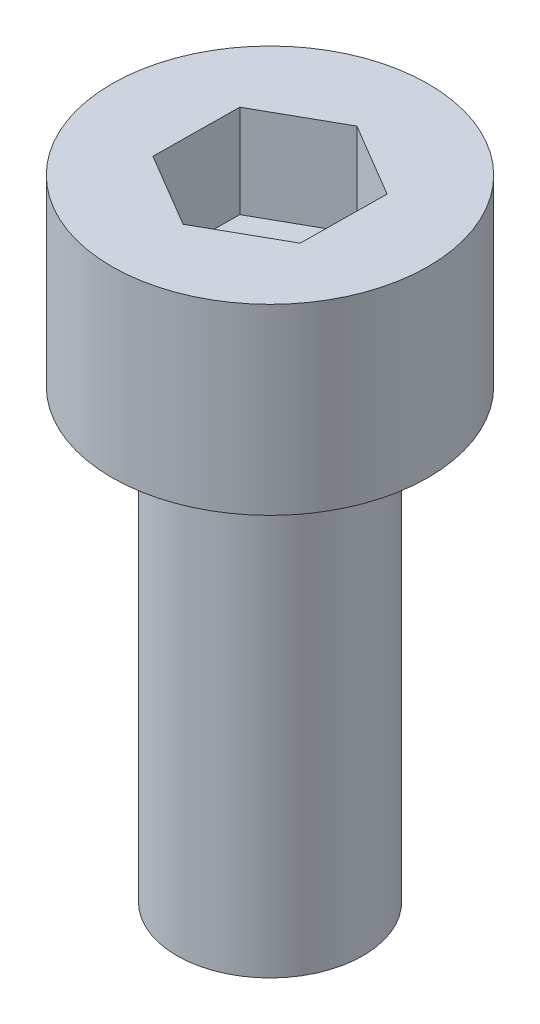
ISO-10303-21;
HEADER;
FILE_DESCRIPTION(('STEP AP214'),'2;1');
FILE_NAME('part.step','',(''),(''),'','','');
FILE_SCHEMA(('AUTOMOTIVE_DESIGN { 1 0 10303 214 1 1 1 1 }'));
ENDSEC;
DATA;
#1=APPLICATION_CONTEXT('core data for automotive mechanical design processes');
#2=APPLICATION_PROTOCOL_DEFINITION('international standard','automotive_design',2000,#1);
#3=PRODUCT_CONTEXT('',#1,'mechanical');
#4=PRODUCT('Part','Part','',(#3));
#5=PRODUCT_RELATED_PRODUCT_CATEGORY('part','',(#4));
#6=PRODUCT_DEFINITION_FORMATION('','',#4);
#7=PRODUCT_DEFINITION_CONTEXT('part definition',#1,'design');
#8=PRODUCT_DEFINITION('design','',#6,#7);
#9=PRODUCT_DEFINITION_SHAPE('','',#8);
#10=(LENGTH_UNIT() NAMED_UNIT(*) SI_UNIT(.MILLI.,.METRE.));
#11=(NAMED_UNIT(*) PLANE_ANGLE_UNIT() SI_UNIT($,.RADIAN.));
#12=(NAMED_UNIT(*) SI_UNIT($,.STERADIAN.) SOLID_ANGLE_UNIT());
#13=UNCERTAINTY_MEASURE_WITH_UNIT(LENGTH_MEASURE(1.E-05),#10,'distance_accuracy_value','');
#14=(GEOMETRIC_REPRESENTATION_CONTEXT(3) GLOBAL_UNCERTAINTY_ASSIGNED_CONTEXT((#13)) GLOBAL_UNIT_ASSIGNED_CONTEXT((#10,
#11,#12)) REPRESENTATION_CONTEXT('',''));
#15=CARTESIAN_POINT('',(0.,0.,0.));
#16=DIRECTION('',(0.,0.,1.));
#17=DIRECTION('',(1.,0.,0.));
#18=AXIS2_PLACEMENT_3D('',#15,#16,#17);
#19=CARTESIAN_POINT('',(0.,12.,0.));
#20=DIRECTION('',(0.,-1.,0.));
#21=DIRECTION('',(0.,0.,-1.));
#22=AXIS2_PLACEMENT_3D('',#19,#20,#21);
#23=CYLINDRICAL_SURFACE('',#22,2.5);
#24=CARTESIAN_POINT('',(0.,12.,0.));
#25=DIRECTION('',(0.,1.,0.));
#26=DIRECTION('',(0.,0.,1.));
#27=AXIS2_PLACEMENT_3D('',#24,#25,#26);
#28=CIRCLE('',#27,2.5);
#29=CARTESIAN_POINT('',(0.,12.,2.5));
#30=VERTEX_POINT('',#29);
#31=EDGE_CURVE('E11',#30,#30,#28,.T.);
#32=ORIENTED_EDGE('',*,*,#31,.F.);
#33=EDGE_LOOP('',(#32));
#34=FACE_BOUND('',#33,.T.);
#35=CARTESIAN_POINT('',(0.,0.,0.));
#36=DIRECTION('',(0.,1.,0.));
#37=DIRECTION('',(0.,0.,1.));
#38=AXIS2_PLACEMENT_3D('',#35,#36,#37);
#39=CIRCLE('',#38,2.5);
#40=CARTESIAN_POINT('',(0.,0.,2.5));
#41=VERTEX_POINT('',#40);
#42=EDGE_CURVE('E42',#41,#41,#39,.T.);
#43=ORIENTED_EDGE('',*,*,#42,.T.);
#44=EDGE_LOOP('',(#43));
#45=FACE_BOUND('',#44,.T.);
#46=ADVANCED_FACE('F39',(#34,#45),#23,.T.);
#47=CARTESIAN_POINT('',(0.,0.,0.));
#48=DIRECTION('',(0.,1.,0.));
#49=DIRECTION('',(0.,0.,1.));
#50=AXIS2_PLACEMENT_3D('',#47,#48,#49);
#51=PLANE('',#50);
#52=ORIENTED_EDGE('',*,*,#42,.F.);
#53=EDGE_LOOP('',(#52));
#54=FACE_BOUND('',#53,.T.);
#55=ADVANCED_FACE('F189',(#54),#51,.F.);
#56=CARTESIAN_POINT('',(0.,16.91,0.));
#57=DIRECTION('',(0.,-1.,0.));
#58=DIRECTION('',(0.,0.,-1.));
#59=AXIS2_PLACEMENT_3D('',#56,#57,#58);
#60=CYLINDRICAL_SURFACE('',#59,4.25);
#61=CARTESIAN_POINT('',(0.,16.91,0.));
#62=DIRECTION('',(0.,1.,0.));
#63=DIRECTION('',(0.,0.,1.));
#64=AXIS2_PLACEMENT_3D('',#61,#62,#63);
#65=CIRCLE('',#64,4.25);
#66=CARTESIAN_POINT('',(0.,16.91,4.25));
#67=VERTEX_POINT('',#66);
#68=EDGE_CURVE('E163',#67,#67,#65,.T.);
#69=ORIENTED_EDGE('',*,*,#68,.F.);
#70=EDGE_LOOP('',(#69));
#71=FACE_BOUND('',#70,.T.);
#72=CARTESIAN_POINT('',(0.,12.,0.));
#73=DIRECTION('',(0.,1.,0.));
#74=DIRECTION('',(0.,0.,1.));
#75=AXIS2_PLACEMENT_3D('',#72,#73,#74);
#76=CIRCLE('',#75,4.25);
#77=CARTESIAN_POINT('',(0.,12.,4.25));
#78=VERTEX_POINT('',#77);
#79=EDGE_CURVE('E153',#78,#78,#76,.T.);
#80=ORIENTED_EDGE('',*,*,#79,.T.);
#81=EDGE_LOOP('',(#80));
#82=FACE_BOUND('',#81,.T.);
#83=ADVANCED_FACE('F171',(#71,#82),#60,.T.);
#84=CARTESIAN_POINT('',(0.,16.91,0.));
#85=DIRECTION('',(0.,1.,0.));
#86=DIRECTION('',(0.,0.,1.));
#87=AXIS2_PLACEMENT_3D('',#84,#85,#86);
#88=PLANE('',#87);
#89=DIRECTION('',(0.871446941935933,0.,-0.490489783166286));
#90=VECTOR('',#89,1.);
#91=CARTESIAN_POINT('',(-0.0252806866898007,16.91,2.3092627005635));
#92=LINE('',#91,#90);
#93=CARTESIAN_POINT('',(-0.0252806866898007,16.91,2.3092627005635));
#94=VERTEX_POINT('',#93);
#95=CARTESIAN_POINT('',(1.98723981935495,16.91,1.17652506718023));
#96=VERTEX_POINT('',#95);
#97=EDGE_CURVE('E54',#94,#96,#92,.T.);
#98=ORIENTED_EDGE('',*,*,#97,.F.);
#99=DIRECTION('',(0.860500083486691,0.,0.509450298183638));
#100=VECTOR('',#99,1.);
#101=CARTESIAN_POINT('',(-2.01252050604475,16.91,1.13273763338327));
#102=LINE('',#101,#100);
#103=CARTESIAN_POINT('',(-2.01252050604475,16.91,1.13273763338327));
#104=VERTEX_POINT('',#103);
#105=EDGE_CURVE('E147',#104,#94,#102,.T.);
#106=ORIENTED_EDGE('',*,*,#105,.F.);
#107=DIRECTION('',(-0.0109468584492415,0.,0.999940081349924));
#108=VECTOR('',#107,1.);
#109=CARTESIAN_POINT('',(-1.98723981935495,16.91,-1.17652506718023));
#110=LINE('',#109,#108);
#111=CARTESIAN_POINT('',(-1.98723981935495,16.91,-1.17652506718023));
#112=VERTEX_POINT('',#111);
#113=EDGE_CURVE('E144',#112,#104,#110,.T.);
#114=ORIENTED_EDGE('',*,*,#113,.F.);
#115=DIRECTION('',(-0.871446941935933,0.,0.490489783166286));
#116=VECTOR('',#115,1.);
#117=CARTESIAN_POINT('',(0.0252806866898017,16.91,-2.3092627005635));
#118=LINE('',#117,#116);
#119=CARTESIAN_POINT('',(0.0252806866898017,16.91,-2.3092627005635));
#120=VERTEX_POINT('',#119);
#121=EDGE_CURVE('E102',#120,#112,#118,.T.);
#122=ORIENTED_EDGE('',*,*,#121,.F.);
#123=DIRECTION('',(-0.860500083486691,0.,-0.509450298183638));
#124=VECTOR('',#123,1.);
#125=CARTESIAN_POINT('',(2.01252050604475,16.91,-1.13273763338327));
#126=LINE('',#125,#124);
#127=CARTESIAN_POINT('',(2.01252050604475,16.91,-1.13273763338327));
#128=VERTEX_POINT('',#127);
#129=EDGE_CURVE('E138',#128,#120,#126,.T.);
#130=ORIENTED_EDGE('',*,*,#129,.F.);
#131=DIRECTION('',(0.0109468584492411,0.,-0.999940081349924));
#132=VECTOR('',#131,1.);
#133=CARTESIAN_POINT('',(1.98723981935495,16.91,1.17652506718023));
#134=LINE('',#133,#132);
#135=EDGE_CURVE('E134',#96,#128,#134,.T.);
#136=ORIENTED_EDGE('',*,*,#135,.F.);
#137=EDGE_LOOP('',(#98,#106,#114,#122,#130,#136));
#138=FACE_BOUND('',#137,.T.);
#139=ORIENTED_EDGE('',*,*,#68,.T.);
#140=EDGE_LOOP('',(#139));
#141=FACE_BOUND('',#140,.T.);
#142=ADVANCED_FACE('F176',(#138,#141),#88,.T.);
#143=CARTESIAN_POINT('',(0.,12.,0.));
#144=DIRECTION('',(0.,1.,0.));
#145=DIRECTION('',(0.,0.,1.));
#146=AXIS2_PLACEMENT_3D('',#143,#144,#145);
#147=PLANE('',#146);
#148=ORIENTED_EDGE('',*,*,#31,.T.);
#149=EDGE_LOOP('',(#148));
#150=FACE_BOUND('',#149,.T.);
#151=ORIENTED_EDGE('',*,*,#79,.F.);
#152=EDGE_LOOP('',(#151));
#153=FACE_BOUND('',#152,.T.);
#154=ADVANCED_FACE('F173',(#150,#153),#147,.F.);
#155=CARTESIAN_POINT('',(-0.0252806866898007,14.41,2.3092627005635));
#156=DIRECTION('',(0.490489783166286,0.,0.871446941935933));
#157=DIRECTION('',(0.871446941935933,0.,-0.490489783166286));
#158=AXIS2_PLACEMENT_3D('',#155,#156,#157);
#159=PLANE('',#158);
#160=ORIENTED_EDGE('',*,*,#97,.T.);
#161=DIRECTION('',(0.,1.,0.));
#162=VECTOR('',#161,1.);
#163=CARTESIAN_POINT('',(1.98723981935495,14.41,1.17652506718023));
#164=LINE('',#163,#162);
#165=CARTESIAN_POINT('',(1.98723981935495,14.41,1.17652506718023));
#166=VERTEX_POINT('',#165);
#167=EDGE_CURVE('E84',#166,#96,#164,.T.);
#168=ORIENTED_EDGE('',*,*,#167,.F.);
#169=DIRECTION('',(0.871446941935933,0.,-0.490489783166286));
#170=VECTOR('',#169,1.);
#171=CARTESIAN_POINT('',(-0.0252806866898007,14.41,2.3092627005635));
#172=LINE('',#171,#170);
#173=CARTESIAN_POINT('',(-0.0252806866898007,14.41,2.3092627005635));
#174=VERTEX_POINT('',#173);
#175=EDGE_CURVE('E150',#174,#166,#172,.T.);
#176=ORIENTED_EDGE('',*,*,#175,.F.);
#177=DIRECTION('',(0.,1.,0.));
#178=VECTOR('',#177,1.);
#179=CARTESIAN_POINT('',(-0.0252806866898007,14.41,2.3092627005635));
#180=LINE('',#179,#178);
#181=EDGE_CURVE('E62',#174,#94,#180,.T.);
#182=ORIENTED_EDGE('',*,*,#181,.T.);
#183=EDGE_LOOP('',(#160,#168,#176,#182));
#184=FACE_BOUND('',#183,.T.);
#185=ADVANCED_FACE('F175',(#184),#159,.F.);
#186=CARTESIAN_POINT('',(-2.01252050604475,14.41,1.13273763338327));
#187=DIRECTION('',(-0.509450298183638,0.,0.860500083486691));
#188=DIRECTION('',(0.860500083486691,0.,0.509450298183638));
#189=AXIS2_PLACEMENT_3D('',#186,#187,#188);
#190=PLANE('',#189);
#191=ORIENTED_EDGE('',*,*,#105,.T.);
#192=ORIENTED_EDGE('',*,*,#181,.F.);
#193=DIRECTION('',(0.860500083486691,0.,0.509450298183638));
#194=VECTOR('',#193,1.);
#195=CARTESIAN_POINT('',(-2.01252050604475,14.41,1.13273763338327));
#196=LINE('',#195,#194);
#197=CARTESIAN_POINT('',(-2.01252050604475,14.41,1.13273763338327));
#198=VERTEX_POINT('',#197);
#199=EDGE_CURVE('E116',#198,#174,#196,.T.);
#200=ORIENTED_EDGE('',*,*,#199,.F.);
#201=DIRECTION('',(0.,1.,0.));
#202=VECTOR('',#201,1.);
#203=CARTESIAN_POINT('',(-2.01252050604475,14.41,1.13273763338327));
#204=LINE('',#203,#202);
#205=EDGE_CURVE('E107',#198,#104,#204,.T.);
#206=ORIENTED_EDGE('',*,*,#205,.T.);
#207=EDGE_LOOP('',(#191,#192,#200,#206));
#208=FACE_BOUND('',#207,.T.);
#209=ADVANCED_FACE('F183',(#208),#190,.F.);
#210=CARTESIAN_POINT('',(-1.98723981935495,14.41,-1.17652506718023));
#211=DIRECTION('',(-0.999940081349924,0.,-0.0109468584492415));
#212=DIRECTION('',(-0.0109468584492415,0.,0.999940081349924));
#213=AXIS2_PLACEMENT_3D('',#210,#211,#212);
#214=PLANE('',#213);
#215=ORIENTED_EDGE('',*,*,#113,.T.);
#216=ORIENTED_EDGE('',*,*,#205,.F.);
#217=DIRECTION('',(-0.0109468584492415,0.,0.999940081349924));
#218=VECTOR('',#217,1.);
#219=CARTESIAN_POINT('',(-1.98723981935495,14.41,-1.17652506718023));
#220=LINE('',#219,#218);
#221=CARTESIAN_POINT('',(-1.98723981935495,14.41,-1.17652506718023));
#222=VERTEX_POINT('',#221);
#223=EDGE_CURVE('E111',#222,#198,#220,.T.);
#224=ORIENTED_EDGE('',*,*,#223,.F.);
#225=DIRECTION('',(0.,1.,0.));
#226=VECTOR('',#225,1.);
#227=CARTESIAN_POINT('',(-1.98723981935495,14.41,-1.17652506718023));
#228=LINE('',#227,#226);
#229=EDGE_CURVE('E95',#222,#112,#228,.T.);
#230=ORIENTED_EDGE('',*,*,#229,.T.);
#231=EDGE_LOOP('',(#215,#216,#224,#230));
#232=FACE_BOUND('',#231,.T.);
#233=ADVANCED_FACE('F112',(#232),#214,.F.);
#234=CARTESIAN_POINT('',(0.0252806866898017,14.41,-2.3092627005635));
#235=DIRECTION('',(-0.490489783166286,0.,-0.871446941935933));
#236=DIRECTION('',(-0.871446941935933,0.,0.490489783166286));
#237=AXIS2_PLACEMENT_3D('',#234,#235,#236);
#238=PLANE('',#237);
#239=ORIENTED_EDGE('',*,*,#121,.T.);
#240=ORIENTED_EDGE('',*,*,#229,.F.);
#241=DIRECTION('',(-0.871446941935933,0.,0.490489783166286));
#242=VECTOR('',#241,1.);
#243=CARTESIAN_POINT('',(0.0252806866898017,14.41,-2.3092627005635));
#244=LINE('',#243,#242);
#245=CARTESIAN_POINT('',(0.0252806866898017,14.41,-2.3092627005635));
#246=VERTEX_POINT('',#245);
#247=EDGE_CURVE('E99',#246,#222,#244,.T.);
#248=ORIENTED_EDGE('',*,*,#247,.F.);
#249=DIRECTION('',(0.,1.,0.));
#250=VECTOR('',#249,1.);
#251=CARTESIAN_POINT('',(0.0252806866898017,14.41,-2.3092627005635));
#252=LINE('',#251,#250);
#253=EDGE_CURVE('E108',#246,#120,#252,.T.);
#254=ORIENTED_EDGE('',*,*,#253,.T.);
#255=EDGE_LOOP('',(#239,#240,#248,#254));
#256=FACE_BOUND('',#255,.T.);
#257=ADVANCED_FACE('F97',(#256),#238,.F.);
#258=CARTESIAN_POINT('',(2.01252050604475,14.41,-1.13273763338327));
#259=DIRECTION('',(0.509450298183638,0.,-0.860500083486691));
#260=DIRECTION('',(-0.860500083486691,0.,-0.509450298183638));
#261=AXIS2_PLACEMENT_3D('',#258,#259,#260);
#262=PLANE('',#261);
#263=ORIENTED_EDGE('',*,*,#129,.T.);
#264=ORIENTED_EDGE('',*,*,#253,.F.);
#265=DIRECTION('',(-0.860500083486691,0.,-0.509450298183638));
#266=VECTOR('',#265,1.);
#267=CARTESIAN_POINT('',(2.01252050604475,14.41,-1.13273763338327));
#268=LINE('',#267,#266);
#269=CARTESIAN_POINT('',(2.01252050604475,14.41,-1.13273763338327));
#270=VERTEX_POINT('',#269);
#271=EDGE_CURVE('E122',#270,#246,#268,.T.);
#272=ORIENTED_EDGE('',*,*,#271,.F.);
#273=DIRECTION('',(0.,1.,0.));
#274=VECTOR('',#273,1.);
#275=CARTESIAN_POINT('',(2.01252050604475,14.41,-1.13273763338327));
#276=LINE('',#275,#274);
#277=EDGE_CURVE('E158',#270,#128,#276,.T.);
#278=ORIENTED_EDGE('',*,*,#277,.T.);
#279=EDGE_LOOP('',(#263,#264,#272,#278));
#280=FACE_BOUND('',#279,.T.);
#281=ADVANCED_FACE('F245',(#280),#262,.F.);
#282=CARTESIAN_POINT('',(1.98723981935495,14.41,1.17652506718023));
#283=DIRECTION('',(0.999940081349924,0.,0.0109468584492411));
#284=DIRECTION('',(0.0109468584492411,0.,-0.999940081349924));
#285=AXIS2_PLACEMENT_3D('',#282,#283,#284);
#286=PLANE('',#285);
#287=ORIENTED_EDGE('',*,*,#135,.T.);
#288=ORIENTED_EDGE('',*,*,#277,.F.);
#289=DIRECTION('',(0.0109468584492411,0.,-0.999940081349924));
#290=VECTOR('',#289,1.);
#291=CARTESIAN_POINT('',(1.98723981935495,14.41,1.17652506718023));
#292=LINE('',#291,#290);
#293=EDGE_CURVE('E126',#166,#270,#292,.T.);
#294=ORIENTED_EDGE('',*,*,#293,.F.);
#295=ORIENTED_EDGE('',*,*,#167,.T.);
#296=EDGE_LOOP('',(#287,#288,#294,#295));
#297=FACE_BOUND('',#296,.T.);
#298=ADVANCED_FACE('F254',(#297),#286,.F.);
#299=CARTESIAN_POINT('',(0.,14.41,0.));
#300=DIRECTION('',(0.,1.,0.));
#301=DIRECTION('',(0.,0.,1.));
#302=AXIS2_PLACEMENT_3D('',#299,#300,#301);
#303=PLANE('',#302);
#304=ORIENTED_EDGE('',*,*,#175,.T.);
#305=ORIENTED_EDGE('',*,*,#293,.T.);
#306=ORIENTED_EDGE('',*,*,#271,.T.);
#307=ORIENTED_EDGE('',*,*,#247,.T.);
#308=ORIENTED_EDGE('',*,*,#223,.T.);
#309=ORIENTED_EDGE('',*,*,#199,.T.);
#310=EDGE_LOOP('',(#304,#305,#306,#307,#308,#309));
#311=FACE_BOUND('',#310,.T.);
#312=ADVANCED_FACE('F119',(#311),#303,.T.);
#313=CLOSED_SHELL('',(#46,#55,#83,#142,#154,#185,#209,#233,#257,#281,#298,#312));
#314=MANIFOLD_SOLID_BREP('B2',#313);
#315=ADVANCED_BREP_SHAPE_REPRESENTATION('',(#18,#314),#14);
#316=SHAPE_DEFINITION_REPRESENTATION(#9,#315);
ENDSEC;
END-ISO-10303-21;
